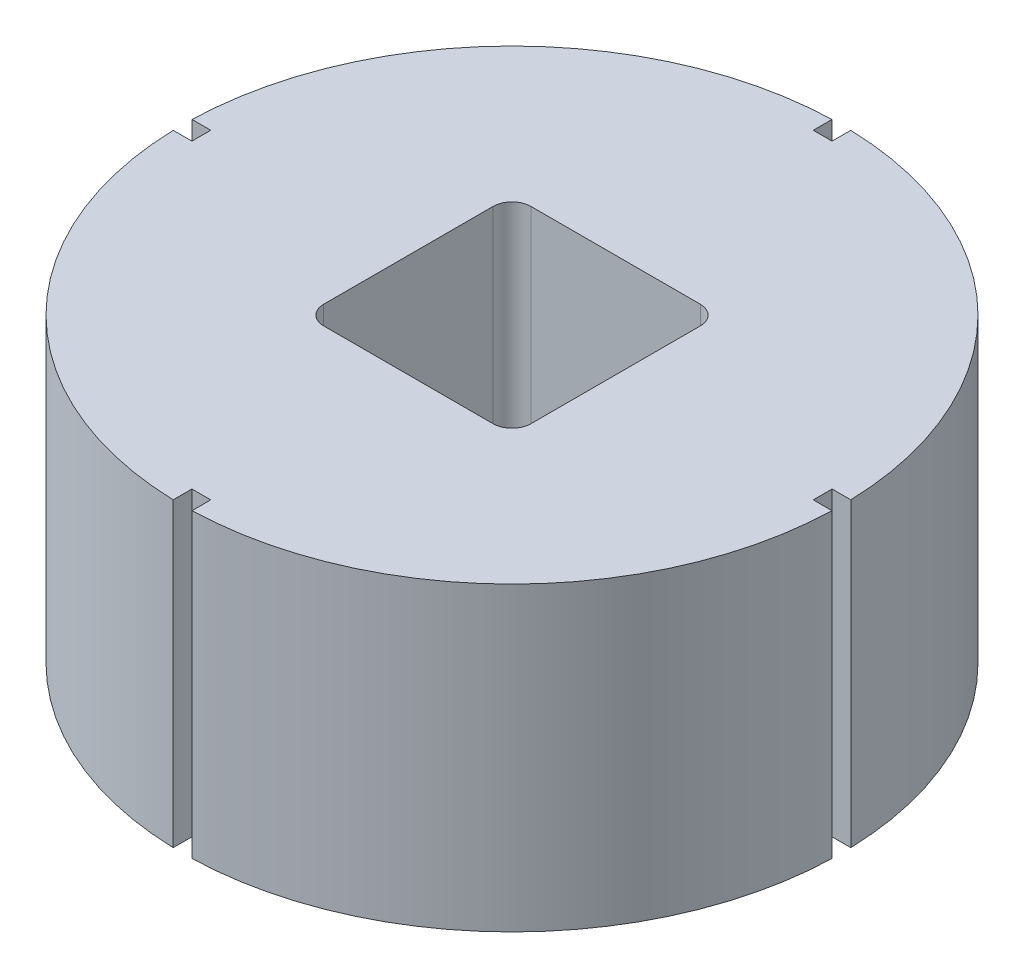
ISO-10303-21;
HEADER;
FILE_DESCRIPTION(('STEP AP214'),'2;1');
FILE_NAME('part.step','',(''),(''),'','','');
FILE_SCHEMA(('AUTOMOTIVE_DESIGN { 1 0 10303 214 1 1 1 1 }'));
ENDSEC;
DATA;
#1=APPLICATION_CONTEXT('core data for automotive mechanical design processes');
#2=APPLICATION_PROTOCOL_DEFINITION('international standard','automotive_design',2000,#1);
#3=PRODUCT_CONTEXT('',#1,'mechanical');
#4=PRODUCT('Part','Part','',(#3));
#5=PRODUCT_RELATED_PRODUCT_CATEGORY('part','',(#4));
#6=PRODUCT_DEFINITION_FORMATION('','',#4);
#7=PRODUCT_DEFINITION_CONTEXT('part definition',#1,'design');
#8=PRODUCT_DEFINITION('design','',#6,#7);
#9=PRODUCT_DEFINITION_SHAPE('','',#8);
#10=(LENGTH_UNIT() NAMED_UNIT(*) SI_UNIT(.MILLI.,.METRE.));
#11=(NAMED_UNIT(*) PLANE_ANGLE_UNIT() SI_UNIT($,.RADIAN.));
#12=(NAMED_UNIT(*) SI_UNIT($,.STERADIAN.) SOLID_ANGLE_UNIT());
#13=UNCERTAINTY_MEASURE_WITH_UNIT(LENGTH_MEASURE(1.E-05),#10,'distance_accuracy_value','');
#14=(GEOMETRIC_REPRESENTATION_CONTEXT(3) GLOBAL_UNCERTAINTY_ASSIGNED_CONTEXT((#13)) GLOBAL_UNIT_ASSIGNED_CONTEXT((#10,
#11,#12)) REPRESENTATION_CONTEXT('',''));
#15=CARTESIAN_POINT('',(0.,0.,0.));
#16=DIRECTION('',(0.,0.,1.));
#17=DIRECTION('',(1.,0.,0.));
#18=AXIS2_PLACEMENT_3D('',#15,#16,#17);
#19=CARTESIAN_POINT('',(0.,32.,0.));
#20=DIRECTION('',(0.,-1.,0.));
#21=DIRECTION('',(0.,0.,-1.));
#22=AXIS2_PLACEMENT_3D('',#19,#20,#21);
#23=CYLINDRICAL_SURFACE('',#22,35.);
#24=CARTESIAN_POINT('',(0.,0.,0.));
#25=DIRECTION('',(0.,1.,0.));
#26=DIRECTION('',(0.,0.,1.));
#27=AXIS2_PLACEMENT_3D('',#24,#25,#26);
#28=CIRCLE('',#27,35.);
#29=CARTESIAN_POINT('',(34.9857113690718,0.,-1.));
#30=VERTEX_POINT('',#29);
#31=CARTESIAN_POINT('',(1.,0.,-34.9857113690718));
#32=VERTEX_POINT('',#31);
#33=EDGE_CURVE('E231',#30,#32,#28,.T.);
#34=ORIENTED_EDGE('',*,*,#33,.T.);
#35=DIRECTION('',(0.,1.,0.));
#36=VECTOR('',#35,1.);
#37=CARTESIAN_POINT('',(1.,-4.,-34.9857113690718));
#38=LINE('',#37,#36);
#39=CARTESIAN_POINT('',(1.,32.,-34.9857113690718));
#40=VERTEX_POINT('',#39);
#41=EDGE_CURVE('E270',#32,#40,#38,.T.);
#42=ORIENTED_EDGE('',*,*,#41,.T.);
#43=CARTESIAN_POINT('',(0.,32.,0.));
#44=DIRECTION('',(0.,1.,0.));
#45=DIRECTION('',(0.,0.,1.));
#46=AXIS2_PLACEMENT_3D('',#43,#44,#45);
#47=CIRCLE('',#46,35.);
#48=CARTESIAN_POINT('',(34.9857113690718,32.,-1.));
#49=VERTEX_POINT('',#48);
#50=EDGE_CURVE('E217',#49,#40,#47,.T.);
#51=ORIENTED_EDGE('',*,*,#50,.F.);
#52=DIRECTION('',(0.,1.,0.));
#53=VECTOR('',#52,1.);
#54=CARTESIAN_POINT('',(34.9857113690718,-4.,-1.));
#55=LINE('',#54,#53);
#56=EDGE_CURVE('E286',#30,#49,#55,.T.);
#57=ORIENTED_EDGE('',*,*,#56,.F.);
#58=EDGE_LOOP('',(#34,#42,#51,#57));
#59=FACE_BOUND('',#58,.T.);
#60=ADVANCED_FACE('F32',(#59),#23,.T.);
#61=CARTESIAN_POINT('',(1.00000000000001,0.,34.9857113690718));
#62=VERTEX_POINT('',#61);
#63=CARTESIAN_POINT('',(34.9857113690718,0.,0.999999999999998));
#64=VERTEX_POINT('',#63);
#65=EDGE_CURVE('E223',#62,#64,#28,.T.);
#66=ORIENTED_EDGE('',*,*,#65,.T.);
#67=DIRECTION('',(0.,1.,0.));
#68=VECTOR('',#67,1.);
#69=CARTESIAN_POINT('',(34.9857113690718,-4.,0.999999999999998));
#70=LINE('',#69,#68);
#71=CARTESIAN_POINT('',(34.9857113690718,32.,0.999999999999998));
#72=VERTEX_POINT('',#71);
#73=EDGE_CURVE('E213',#64,#72,#70,.T.);
#74=ORIENTED_EDGE('',*,*,#73,.T.);
#75=CARTESIAN_POINT('',(1.00000000000001,32.,34.9857113690718));
#76=VERTEX_POINT('',#75);
#77=EDGE_CURVE('E221',#76,#72,#47,.T.);
#78=ORIENTED_EDGE('',*,*,#77,.F.);
#79=DIRECTION('',(0.,1.,0.));
#80=VECTOR('',#79,1.);
#81=CARTESIAN_POINT('',(1.00000000000001,-4.,34.9857113690718));
#82=LINE('',#81,#80);
#83=EDGE_CURVE('E301',#62,#76,#82,.T.);
#84=ORIENTED_EDGE('',*,*,#83,.F.);
#85=EDGE_LOOP('',(#66,#74,#78,#84));
#86=FACE_BOUND('',#85,.T.);
#87=ADVANCED_FACE('F410',(#86),#23,.T.);
#88=CARTESIAN_POINT('',(-34.9857113690718,0.,1.00000000000001));
#89=VERTEX_POINT('',#88);
#90=CARTESIAN_POINT('',(-0.999999999999996,0.,34.9857113690718));
#91=VERTEX_POINT('',#90);
#92=EDGE_CURVE('E232',#89,#91,#28,.T.);
#93=ORIENTED_EDGE('',*,*,#92,.T.);
#94=DIRECTION('',(0.,1.,0.));
#95=VECTOR('',#94,1.);
#96=CARTESIAN_POINT('',(-0.999999999999996,-4.,34.9857113690718));
#97=LINE('',#96,#95);
#98=CARTESIAN_POINT('',(-0.999999999999996,32.,34.9857113690718));
#99=VERTEX_POINT('',#98);
#100=EDGE_CURVE('E281',#91,#99,#97,.T.);
#101=ORIENTED_EDGE('',*,*,#100,.T.);
#102=CARTESIAN_POINT('',(-34.9857113690718,32.,1.00000000000001));
#103=VERTEX_POINT('',#102);
#104=EDGE_CURVE('E218',#103,#99,#47,.T.);
#105=ORIENTED_EDGE('',*,*,#104,.F.);
#106=DIRECTION('',(0.,1.,0.));
#107=VECTOR('',#106,1.);
#108=CARTESIAN_POINT('',(-34.9857113690718,-4.,1.00000000000001));
#109=LINE('',#108,#107);
#110=EDGE_CURVE('E317',#89,#103,#109,.T.);
#111=ORIENTED_EDGE('',*,*,#110,.F.);
#112=EDGE_LOOP('',(#93,#101,#105,#111));
#113=FACE_BOUND('',#112,.T.);
#114=ADVANCED_FACE('F424',(#113),#23,.T.);
#115=CARTESIAN_POINT('',(-1.,32.,-34.9857113690718));
#116=VERTEX_POINT('',#115);
#117=CARTESIAN_POINT('',(-34.9857113690718,32.,-0.999999999999994));
#118=VERTEX_POINT('',#117);
#119=EDGE_CURVE('E210',#116,#118,#47,.T.);
#120=ORIENTED_EDGE('',*,*,#119,.F.);
#121=DIRECTION('',(0.,1.,0.));
#122=VECTOR('',#121,1.);
#123=CARTESIAN_POINT('',(-1.,-4.,-34.9857113690718));
#124=LINE('',#123,#122);
#125=CARTESIAN_POINT('',(-1.,0.,-34.9857113690718));
#126=VERTEX_POINT('',#125);
#127=EDGE_CURVE('E191',#126,#116,#124,.T.);
#128=ORIENTED_EDGE('',*,*,#127,.F.);
#129=CARTESIAN_POINT('',(-34.9857113690718,0.,-0.999999999999994));
#130=VERTEX_POINT('',#129);
#131=EDGE_CURVE('E391',#126,#130,#28,.T.);
#132=ORIENTED_EDGE('',*,*,#131,.T.);
#133=DIRECTION('',(0.,1.,0.));
#134=VECTOR('',#133,1.);
#135=CARTESIAN_POINT('',(-34.9857113690718,-4.,-0.999999999999994));
#136=LINE('',#135,#134);
#137=EDGE_CURVE('E216',#130,#118,#136,.T.);
#138=ORIENTED_EDGE('',*,*,#137,.T.);
#139=EDGE_LOOP('',(#120,#128,#132,#138));
#140=FACE_BOUND('',#139,.T.);
#141=ADVANCED_FACE('F34',(#140),#23,.T.);
#142=CARTESIAN_POINT('',(0.,32.,0.));
#143=DIRECTION('',(0.,1.,0.));
#144=DIRECTION('',(0.,0.,1.));
#145=AXIS2_PLACEMENT_3D('',#142,#143,#144);
#146=PLANE('',#145);
#147=DIRECTION('',(0.,0.,-1.));
#148=VECTOR('',#147,1.);
#149=CARTESIAN_POINT('',(1.,32.,-33.));
#150=LINE('',#149,#148);
#151=CARTESIAN_POINT('',(1.,32.,-33.));
#152=VERTEX_POINT('',#151);
#153=EDGE_CURVE('E202',#152,#40,#150,.T.);
#154=ORIENTED_EDGE('',*,*,#153,.F.);
#155=DIRECTION('',(1.,0.,0.));
#156=VECTOR('',#155,1.);
#157=CARTESIAN_POINT('',(-1.,32.,-33.));
#158=LINE('',#157,#156);
#159=CARTESIAN_POINT('',(-1.,32.,-33.));
#160=VERTEX_POINT('',#159);
#161=EDGE_CURVE('E212',#160,#152,#158,.T.);
#162=ORIENTED_EDGE('',*,*,#161,.F.);
#163=DIRECTION('',(0.,0.,1.));
#164=VECTOR('',#163,1.);
#165=CARTESIAN_POINT('',(-1.,32.,-34.9857113690718));
#166=LINE('',#165,#164);
#167=EDGE_CURVE('E194',#116,#160,#166,.T.);
#168=ORIENTED_EDGE('',*,*,#167,.F.);
#169=ORIENTED_EDGE('',*,*,#119,.T.);
#170=DIRECTION('',(-1.,0.,0.));
#171=VECTOR('',#170,1.);
#172=CARTESIAN_POINT('',(-33.,32.,-0.999999999999994));
#173=LINE('',#172,#171);
#174=CARTESIAN_POINT('',(-33.,32.,-0.999999999999994));
#175=VERTEX_POINT('',#174);
#176=EDGE_CURVE('E315',#175,#118,#173,.T.);
#177=ORIENTED_EDGE('',*,*,#176,.F.);
#178=DIRECTION('',(0.,0.,-1.));
#179=VECTOR('',#178,1.);
#180=CARTESIAN_POINT('',(-33.,32.,1.00000000000001));
#181=LINE('',#180,#179);
#182=CARTESIAN_POINT('',(-33.,32.,1.00000000000001));
#183=VERTEX_POINT('',#182);
#184=EDGE_CURVE('E312',#183,#175,#181,.T.);
#185=ORIENTED_EDGE('',*,*,#184,.F.);
#186=DIRECTION('',(1.,0.,0.));
#187=VECTOR('',#186,1.);
#188=CARTESIAN_POINT('',(-34.9857113690718,32.,1.00000000000001));
#189=LINE('',#188,#187);
#190=EDGE_CURVE('E309',#103,#183,#189,.T.);
#191=ORIENTED_EDGE('',*,*,#190,.F.);
#192=ORIENTED_EDGE('',*,*,#104,.T.);
#193=DIRECTION('',(0.,0.,1.));
#194=VECTOR('',#193,1.);
#195=CARTESIAN_POINT('',(-0.999999999999996,32.,33.));
#196=LINE('',#195,#194);
#197=CARTESIAN_POINT('',(-0.999999999999996,32.,33.));
#198=VERTEX_POINT('',#197);
#199=EDGE_CURVE('E299',#198,#99,#196,.T.);
#200=ORIENTED_EDGE('',*,*,#199,.F.);
#201=DIRECTION('',(-1.,0.,0.));
#202=VECTOR('',#201,1.);
#203=CARTESIAN_POINT('',(1.00000000000001,32.,33.));
#204=LINE('',#203,#202);
#205=CARTESIAN_POINT('',(1.00000000000001,32.,33.));
#206=VERTEX_POINT('',#205);
#207=EDGE_CURVE('E296',#206,#198,#204,.T.);
#208=ORIENTED_EDGE('',*,*,#207,.F.);
#209=DIRECTION('',(0.,0.,-1.));
#210=VECTOR('',#209,1.);
#211=CARTESIAN_POINT('',(1.00000000000001,32.,34.9857113690718));
#212=LINE('',#211,#210);
#213=EDGE_CURVE('E293',#76,#206,#212,.T.);
#214=ORIENTED_EDGE('',*,*,#213,.F.);
#215=ORIENTED_EDGE('',*,*,#77,.T.);
#216=DIRECTION('',(1.,0.,0.));
#217=VECTOR('',#216,1.);
#218=CARTESIAN_POINT('',(33.,32.,0.999999999999998));
#219=LINE('',#218,#217);
#220=CARTESIAN_POINT('',(33.,32.,0.999999999999998));
#221=VERTEX_POINT('',#220);
#222=EDGE_CURVE('E284',#221,#72,#219,.T.);
#223=ORIENTED_EDGE('',*,*,#222,.F.);
#224=DIRECTION('',(0.,0.,1.));
#225=VECTOR('',#224,1.);
#226=CARTESIAN_POINT('',(33.,32.,-1.));
#227=LINE('',#226,#225);
#228=CARTESIAN_POINT('',(33.,32.,-1.));
#229=VERTEX_POINT('',#228);
#230=EDGE_CURVE('E280',#229,#221,#227,.T.);
#231=ORIENTED_EDGE('',*,*,#230,.F.);
#232=DIRECTION('',(-1.,0.,0.));
#233=VECTOR('',#232,1.);
#234=CARTESIAN_POINT('',(34.9857113690718,32.,-1.));
#235=LINE('',#234,#233);
#236=EDGE_CURVE('E278',#49,#229,#235,.T.);
#237=ORIENTED_EDGE('',*,*,#236,.F.);
#238=ORIENTED_EDGE('',*,*,#50,.T.);
#239=EDGE_LOOP('',(#154,#162,#168,#169,#177,#185,#191,#192,#200,#208,#214,#215,#223,#231,#237,#238));
#240=FACE_BOUND('',#239,.T.);
#241=CARTESIAN_POINT('',(-9.,32.,9.));
#242=DIRECTION('',(0.,1.,0.));
#243=DIRECTION('',(0.,0.,1.));
#244=AXIS2_PLACEMENT_3D('',#241,#242,#243);
#245=CIRCLE('',#244,2.);
#246=CARTESIAN_POINT('',(-11.,32.,8.99999999999999));
#247=VERTEX_POINT('',#246);
#248=CARTESIAN_POINT('',(-8.99999999999998,32.,11.));
#249=VERTEX_POINT('',#248);
#250=EDGE_CURVE('E273',#247,#249,#245,.T.);
#251=ORIENTED_EDGE('',*,*,#250,.F.);
#252=DIRECTION('',(0.,0.,1.));
#253=VECTOR('',#252,1.);
#254=CARTESIAN_POINT('',(-11.,32.,-8.99999999999998));
#255=LINE('',#254,#253);
#256=CARTESIAN_POINT('',(-11.,32.,-8.99999999999998));
#257=VERTEX_POINT('',#256);
#258=EDGE_CURVE('E328',#257,#247,#255,.T.);
#259=ORIENTED_EDGE('',*,*,#258,.F.);
#260=CARTESIAN_POINT('',(-9.,32.,-9.));
#261=DIRECTION('',(0.,1.,0.));
#262=DIRECTION('',(0.,0.,1.));
#263=AXIS2_PLACEMENT_3D('',#260,#261,#262);
#264=CIRCLE('',#263,2.);
#265=CARTESIAN_POINT('',(-8.99999999999999,32.,-11.));
#266=VERTEX_POINT('',#265);
#267=EDGE_CURVE('E366',#266,#257,#264,.T.);
#268=ORIENTED_EDGE('',*,*,#267,.F.);
#269=DIRECTION('',(-1.,0.,0.));
#270=VECTOR('',#269,1.);
#271=CARTESIAN_POINT('',(-8.99999999999999,32.,-11.));
#272=LINE('',#271,#270);
#273=CARTESIAN_POINT('',(8.99999999999998,32.,-11.));
#274=VERTEX_POINT('',#273);
#275=EDGE_CURVE('E363',#274,#266,#272,.T.);
#276=ORIENTED_EDGE('',*,*,#275,.F.);
#277=CARTESIAN_POINT('',(9.,32.,-9.));
#278=DIRECTION('',(0.,1.,0.));
#279=DIRECTION('',(0.,0.,-1.));
#280=AXIS2_PLACEMENT_3D('',#277,#278,#279);
#281=CIRCLE('',#280,2.);
#282=CARTESIAN_POINT('',(11.,32.,-8.99999999999998));
#283=VERTEX_POINT('',#282);
#284=EDGE_CURVE('E360',#283,#274,#281,.T.);
#285=ORIENTED_EDGE('',*,*,#284,.F.);
#286=DIRECTION('',(0.,0.,-1.));
#287=VECTOR('',#286,1.);
#288=CARTESIAN_POINT('',(11.,32.,-8.99999999999998));
#289=LINE('',#288,#287);
#290=CARTESIAN_POINT('',(11.,32.,8.99999999999999));
#291=VERTEX_POINT('',#290);
#292=EDGE_CURVE('E357',#291,#283,#289,.T.);
#293=ORIENTED_EDGE('',*,*,#292,.F.);
#294=CARTESIAN_POINT('',(9.,32.,9.));
#295=DIRECTION('',(0.,1.,0.));
#296=DIRECTION('',(0.,0.,1.));
#297=AXIS2_PLACEMENT_3D('',#294,#295,#296);
#298=CIRCLE('',#297,2.);
#299=CARTESIAN_POINT('',(8.99999999999999,32.,11.));
#300=VERTEX_POINT('',#299);
#301=EDGE_CURVE('E354',#300,#291,#298,.T.);
#302=ORIENTED_EDGE('',*,*,#301,.F.);
#303=DIRECTION('',(1.,0.,0.));
#304=VECTOR('',#303,1.);
#305=CARTESIAN_POINT('',(-8.99999999999998,32.,11.));
#306=LINE('',#305,#304);
#307=EDGE_CURVE('E351',#249,#300,#306,.T.);
#308=ORIENTED_EDGE('',*,*,#307,.F.);
#309=EDGE_LOOP('',(#251,#259,#268,#276,#285,#293,#302,#308));
#310=FACE_BOUND('',#309,.T.);
#311=ADVANCED_FACE('F207',(#240,#310),#146,.T.);
#312=CARTESIAN_POINT('',(0.,0.,0.));
#313=DIRECTION('',(0.,1.,0.));
#314=DIRECTION('',(0.,0.,1.));
#315=AXIS2_PLACEMENT_3D('',#312,#313,#314);
#316=PLANE('',#315);
#317=CARTESIAN_POINT('',(0.,0.,0.));
#318=DIRECTION('',(0.,-1.,0.));
#319=DIRECTION('',(0.,0.,-1.));
#320=AXIS2_PLACEMENT_3D('',#317,#318,#319);
#321=CIRCLE('',#320,10.);
#322=CARTESIAN_POINT('',(0.,0.,-10.));
#323=VERTEX_POINT('',#322);
#324=EDGE_CURVE('E227',#323,#323,#321,.T.);
#325=ORIENTED_EDGE('',*,*,#324,.F.);
#326=EDGE_LOOP('',(#325));
#327=FACE_BOUND('',#326,.T.);
#328=DIRECTION('',(1.,0.,0.));
#329=VECTOR('',#328,1.);
#330=CARTESIAN_POINT('',(0.,0.,-33.));
#331=LINE('',#330,#329);
#332=CARTESIAN_POINT('',(-1.,0.,-33.));
#333=VERTEX_POINT('',#332);
#334=CARTESIAN_POINT('',(1.,0.,-33.));
#335=VERTEX_POINT('',#334);
#336=EDGE_CURVE('E40',#333,#335,#331,.T.);
#337=ORIENTED_EDGE('',*,*,#336,.T.);
#338=DIRECTION('',(0.,0.,-1.));
#339=VECTOR('',#338,1.);
#340=CARTESIAN_POINT('',(0.999999999999997,0.,0.));
#341=LINE('',#340,#339);
#342=EDGE_CURVE('E11',#335,#32,#341,.T.);
#343=ORIENTED_EDGE('',*,*,#342,.T.);
#344=ORIENTED_EDGE('',*,*,#33,.F.);
#345=DIRECTION('',(-1.,0.,0.));
#346=VECTOR('',#345,1.);
#347=CARTESIAN_POINT('',(0.,0.,-0.999999999999993));
#348=LINE('',#347,#346);
#349=CARTESIAN_POINT('',(33.,0.,-1.));
#350=VERTEX_POINT('',#349);
#351=EDGE_CURVE('E251',#30,#350,#348,.T.);
#352=ORIENTED_EDGE('',*,*,#351,.T.);
#353=DIRECTION('',(0.,0.,1.));
#354=VECTOR('',#353,1.);
#355=CARTESIAN_POINT('',(33.,0.,0.));
#356=LINE('',#355,#354);
#357=CARTESIAN_POINT('',(33.,0.,0.999999999999998));
#358=VERTEX_POINT('',#357);
#359=EDGE_CURVE('E254',#350,#358,#356,.T.);
#360=ORIENTED_EDGE('',*,*,#359,.T.);
#361=DIRECTION('',(1.,0.,0.));
#362=VECTOR('',#361,1.);
#363=CARTESIAN_POINT('',(0.,0.,0.999999999999998));
#364=LINE('',#363,#362);
#365=EDGE_CURVE('E257',#358,#64,#364,.T.);
#366=ORIENTED_EDGE('',*,*,#365,.T.);
#367=ORIENTED_EDGE('',*,*,#65,.F.);
#368=DIRECTION('',(0.,0.,-1.));
#369=VECTOR('',#368,1.);
#370=CARTESIAN_POINT('',(0.999999999999995,0.,0.));
#371=LINE('',#370,#369);
#372=CARTESIAN_POINT('',(1.00000000000001,0.,33.));
#373=VERTEX_POINT('',#372);
#374=EDGE_CURVE('E242',#62,#373,#371,.T.);
#375=ORIENTED_EDGE('',*,*,#374,.T.);
#376=DIRECTION('',(-1.,0.,0.));
#377=VECTOR('',#376,1.);
#378=CARTESIAN_POINT('',(0.,0.,33.));
#379=LINE('',#378,#377);
#380=CARTESIAN_POINT('',(-0.999999999999996,0.,33.));
#381=VERTEX_POINT('',#380);
#382=EDGE_CURVE('E245',#373,#381,#379,.T.);
#383=ORIENTED_EDGE('',*,*,#382,.T.);
#384=DIRECTION('',(0.,0.,1.));
#385=VECTOR('',#384,1.);
#386=CARTESIAN_POINT('',(-0.999999999999996,0.,0.));
#387=LINE('',#386,#385);
#388=EDGE_CURVE('E248',#381,#91,#387,.T.);
#389=ORIENTED_EDGE('',*,*,#388,.T.);
#390=ORIENTED_EDGE('',*,*,#92,.F.);
#391=DIRECTION('',(1.,0.,0.));
#392=VECTOR('',#391,1.);
#393=CARTESIAN_POINT('',(0.,0.,0.999999999999993));
#394=LINE('',#393,#392);
#395=CARTESIAN_POINT('',(-33.,0.,1.00000000000001));
#396=VERTEX_POINT('',#395);
#397=EDGE_CURVE('E233',#89,#396,#394,.T.);
#398=ORIENTED_EDGE('',*,*,#397,.T.);
#399=DIRECTION('',(0.,0.,-1.));
#400=VECTOR('',#399,1.);
#401=CARTESIAN_POINT('',(-33.,0.,0.));
#402=LINE('',#401,#400);
#403=CARTESIAN_POINT('',(-33.,0.,-0.999999999999994));
#404=VERTEX_POINT('',#403);
#405=EDGE_CURVE('E236',#396,#404,#402,.T.);
#406=ORIENTED_EDGE('',*,*,#405,.T.);
#407=DIRECTION('',(-1.,0.,0.));
#408=VECTOR('',#407,1.);
#409=CARTESIAN_POINT('',(0.,0.,-0.999999999999998));
#410=LINE('',#409,#408);
#411=EDGE_CURVE('E239',#404,#130,#410,.T.);
#412=ORIENTED_EDGE('',*,*,#411,.T.);
#413=ORIENTED_EDGE('',*,*,#131,.F.);
#414=DIRECTION('',(0.,0.,1.));
#415=VECTOR('',#414,1.);
#416=CARTESIAN_POINT('',(-0.999999999999994,0.,0.));
#417=LINE('',#416,#415);
#418=EDGE_CURVE('E197',#126,#333,#417,.T.);
#419=ORIENTED_EDGE('',*,*,#418,.T.);
#420=EDGE_LOOP('',(#337,#343,#344,#352,#360,#366,#367,#375,#383,#389,#390,#398,#406,#412,#413,#419));
#421=FACE_BOUND('',#420,.T.);
#422=ADVANCED_FACE('F262',(#327,#421),#316,.F.);
#423=CARTESIAN_POINT('',(0.,-4.99999999999999,0.));
#424=DIRECTION('',(0.,1.,0.));
#425=DIRECTION('',(0.,0.,1.));
#426=AXIS2_PLACEMENT_3D('',#423,#424,#425);
#427=CYLINDRICAL_SURFACE('',#426,10.);
#428=CARTESIAN_POINT('',(0.,-4.99999999999999,0.));
#429=DIRECTION('',(0.,-1.,0.));
#430=DIRECTION('',(0.,0.,-1.));
#431=AXIS2_PLACEMENT_3D('',#428,#429,#430);
#432=CIRCLE('',#431,10.);
#433=CARTESIAN_POINT('',(0.,-4.99999999999999,-10.));
#434=VERTEX_POINT('',#433);
#435=EDGE_CURVE('E373',#434,#434,#432,.T.);
#436=ORIENTED_EDGE('',*,*,#435,.F.);
#437=EDGE_LOOP('',(#436));
#438=FACE_BOUND('',#437,.T.);
#439=ORIENTED_EDGE('',*,*,#324,.T.);
#440=EDGE_LOOP('',(#439));
#441=FACE_BOUND('',#440,.T.);
#442=ADVANCED_FACE('F563',(#438,#441),#427,.T.);
#443=CARTESIAN_POINT('',(0.,-4.99999999999999,0.));
#444=DIRECTION('',(0.,-1.,0.));
#445=DIRECTION('',(0.,0.,-1.));
#446=AXIS2_PLACEMENT_3D('',#443,#444,#445);
#447=PLANE('',#446);
#448=ORIENTED_EDGE('',*,*,#435,.T.);
#449=EDGE_LOOP('',(#448));
#450=FACE_BOUND('',#449,.T.);
#451=ADVANCED_FACE('F553',(#450),#447,.T.);
#452=CARTESIAN_POINT('',(-9.,7.,9.));
#453=DIRECTION('',(0.,1.,0.));
#454=DIRECTION('',(0.,0.,1.));
#455=AXIS2_PLACEMENT_3D('',#452,#453,#454);
#456=CYLINDRICAL_SURFACE('',#455,2.);
#457=ORIENTED_EDGE('',*,*,#250,.T.);
#458=DIRECTION('',(0.,1.,0.));
#459=VECTOR('',#458,1.);
#460=CARTESIAN_POINT('',(-8.99999999999998,7.,11.));
#461=LINE('',#460,#459);
#462=CARTESIAN_POINT('',(-8.99999999999998,7.,11.));
#463=VERTEX_POINT('',#462);
#464=EDGE_CURVE('E349',#463,#249,#461,.T.);
#465=ORIENTED_EDGE('',*,*,#464,.F.);
#466=CARTESIAN_POINT('',(-9.,7.,9.));
#467=DIRECTION('',(0.,1.,0.));
#468=DIRECTION('',(0.,0.,1.));
#469=AXIS2_PLACEMENT_3D('',#466,#467,#468);
#470=CIRCLE('',#469,2.);
#471=CARTESIAN_POINT('',(-11.,7.,8.99999999999999));
#472=VERTEX_POINT('',#471);
#473=EDGE_CURVE('E324',#472,#463,#470,.T.);
#474=ORIENTED_EDGE('',*,*,#473,.F.);
#475=DIRECTION('',(0.,1.,0.));
#476=VECTOR('',#475,1.);
#477=CARTESIAN_POINT('',(-11.,7.,8.99999999999999));
#478=LINE('',#477,#476);
#479=EDGE_CURVE('E371',#472,#247,#478,.T.);
#480=ORIENTED_EDGE('',*,*,#479,.T.);
#481=EDGE_LOOP('',(#457,#465,#474,#480));
#482=FACE_BOUND('',#481,.T.);
#483=ADVANCED_FACE('F543',(#482),#456,.F.);
#484=CARTESIAN_POINT('',(-11.,7.,-8.99999999999998));
#485=DIRECTION('',(-1.,0.,0.));
#486=DIRECTION('',(0.,0.,1.));
#487=AXIS2_PLACEMENT_3D('',#484,#485,#486);
#488=PLANE('',#487);
#489=ORIENTED_EDGE('',*,*,#258,.T.);
#490=ORIENTED_EDGE('',*,*,#479,.F.);
#491=DIRECTION('',(0.,0.,1.));
#492=VECTOR('',#491,1.);
#493=CARTESIAN_POINT('',(-11.,7.,-8.99999999999998));
#494=LINE('',#493,#492);
#495=CARTESIAN_POINT('',(-11.,7.,-8.99999999999998));
#496=VERTEX_POINT('',#495);
#497=EDGE_CURVE('E346',#496,#472,#494,.T.);
#498=ORIENTED_EDGE('',*,*,#497,.F.);
#499=DIRECTION('',(0.,1.,0.));
#500=VECTOR('',#499,1.);
#501=CARTESIAN_POINT('',(-11.,7.,-8.99999999999998));
#502=LINE('',#501,#500);
#503=EDGE_CURVE('E374',#496,#257,#502,.T.);
#504=ORIENTED_EDGE('',*,*,#503,.T.);
#505=EDGE_LOOP('',(#489,#490,#498,#504));
#506=FACE_BOUND('',#505,.T.);
#507=ADVANCED_FACE('F533',(#506),#488,.F.);
#508=CARTESIAN_POINT('',(-9.,7.,-9.));
#509=DIRECTION('',(0.,1.,0.));
#510=DIRECTION('',(0.,0.,1.));
#511=AXIS2_PLACEMENT_3D('',#508,#509,#510);
#512=CYLINDRICAL_SURFACE('',#511,2.);
#513=ORIENTED_EDGE('',*,*,#267,.T.);
#514=ORIENTED_EDGE('',*,*,#503,.F.);
#515=CARTESIAN_POINT('',(-9.,7.,-9.));
#516=DIRECTION('',(0.,1.,0.));
#517=DIRECTION('',(0.,0.,1.));
#518=AXIS2_PLACEMENT_3D('',#515,#516,#517);
#519=CIRCLE('',#518,2.);
#520=CARTESIAN_POINT('',(-8.99999999999999,7.,-11.));
#521=VERTEX_POINT('',#520);
#522=EDGE_CURVE('E343',#521,#496,#519,.T.);
#523=ORIENTED_EDGE('',*,*,#522,.F.);
#524=DIRECTION('',(0.,1.,0.));
#525=VECTOR('',#524,1.);
#526=CARTESIAN_POINT('',(-8.99999999999999,7.,-11.));
#527=LINE('',#526,#525);
#528=EDGE_CURVE('E376',#521,#266,#527,.T.);
#529=ORIENTED_EDGE('',*,*,#528,.T.);
#530=EDGE_LOOP('',(#513,#514,#523,#529));
#531=FACE_BOUND('',#530,.T.);
#532=ADVANCED_FACE('F523',(#531),#512,.F.);
#533=CARTESIAN_POINT('',(-8.99999999999999,7.,-11.));
#534=DIRECTION('',(0.,0.,-1.));
#535=DIRECTION('',(-1.,0.,0.));
#536=AXIS2_PLACEMENT_3D('',#533,#534,#535);
#537=PLANE('',#536);
#538=ORIENTED_EDGE('',*,*,#275,.T.);
#539=ORIENTED_EDGE('',*,*,#528,.F.);
#540=DIRECTION('',(-1.,0.,0.));
#541=VECTOR('',#540,1.);
#542=CARTESIAN_POINT('',(-8.99999999999999,7.,-11.));
#543=LINE('',#542,#541);
#544=CARTESIAN_POINT('',(8.99999999999998,7.,-11.));
#545=VERTEX_POINT('',#544);
#546=EDGE_CURVE('E340',#545,#521,#543,.T.);
#547=ORIENTED_EDGE('',*,*,#546,.F.);
#548=DIRECTION('',(0.,1.,0.));
#549=VECTOR('',#548,1.);
#550=CARTESIAN_POINT('',(8.99999999999998,7.,-11.));
#551=LINE('',#550,#549);
#552=EDGE_CURVE('E378',#545,#274,#551,.T.);
#553=ORIENTED_EDGE('',*,*,#552,.T.);
#554=EDGE_LOOP('',(#538,#539,#547,#553));
#555=FACE_BOUND('',#554,.T.);
#556=ADVANCED_FACE('F513',(#555),#537,.F.);
#557=CARTESIAN_POINT('',(9.,7.,-9.));
#558=DIRECTION('',(0.,1.,0.));
#559=DIRECTION('',(0.,0.,1.));
#560=AXIS2_PLACEMENT_3D('',#557,#558,#559);
#561=CYLINDRICAL_SURFACE('',#560,2.);
#562=ORIENTED_EDGE('',*,*,#284,.T.);
#563=ORIENTED_EDGE('',*,*,#552,.F.);
#564=CARTESIAN_POINT('',(9.,7.,-9.));
#565=DIRECTION('',(0.,1.,0.));
#566=DIRECTION('',(0.,0.,-1.));
#567=AXIS2_PLACEMENT_3D('',#564,#565,#566);
#568=CIRCLE('',#567,2.);
#569=CARTESIAN_POINT('',(11.,7.,-8.99999999999998));
#570=VERTEX_POINT('',#569);
#571=EDGE_CURVE('E337',#570,#545,#568,.T.);
#572=ORIENTED_EDGE('',*,*,#571,.F.);
#573=DIRECTION('',(0.,1.,0.));
#574=VECTOR('',#573,1.);
#575=CARTESIAN_POINT('',(11.,7.,-8.99999999999998));
#576=LINE('',#575,#574);
#577=EDGE_CURVE('E380',#570,#283,#576,.T.);
#578=ORIENTED_EDGE('',*,*,#577,.T.);
#579=EDGE_LOOP('',(#562,#563,#572,#578));
#580=FACE_BOUND('',#579,.T.);
#581=ADVANCED_FACE('F503',(#580),#561,.F.);
#582=CARTESIAN_POINT('',(11.,7.,-8.99999999999998));
#583=DIRECTION('',(1.,0.,0.));
#584=DIRECTION('',(0.,0.,-1.));
#585=AXIS2_PLACEMENT_3D('',#582,#583,#584);
#586=PLANE('',#585);
#587=ORIENTED_EDGE('',*,*,#292,.T.);
#588=ORIENTED_EDGE('',*,*,#577,.F.);
#589=DIRECTION('',(0.,0.,-1.));
#590=VECTOR('',#589,1.);
#591=CARTESIAN_POINT('',(11.,7.,-8.99999999999998));
#592=LINE('',#591,#590);
#593=CARTESIAN_POINT('',(11.,7.,8.99999999999999));
#594=VERTEX_POINT('',#593);
#595=EDGE_CURVE('E334',#594,#570,#592,.T.);
#596=ORIENTED_EDGE('',*,*,#595,.F.);
#597=DIRECTION('',(0.,1.,0.));
#598=VECTOR('',#597,1.);
#599=CARTESIAN_POINT('',(11.,7.,8.99999999999999));
#600=LINE('',#599,#598);
#601=EDGE_CURVE('E382',#594,#291,#600,.T.);
#602=ORIENTED_EDGE('',*,*,#601,.T.);
#603=EDGE_LOOP('',(#587,#588,#596,#602));
#604=FACE_BOUND('',#603,.T.);
#605=ADVANCED_FACE('F493',(#604),#586,.F.);
#606=CARTESIAN_POINT('',(9.,7.,9.));
#607=DIRECTION('',(0.,1.,0.));
#608=DIRECTION('',(0.,0.,1.));
#609=AXIS2_PLACEMENT_3D('',#606,#607,#608);
#610=CYLINDRICAL_SURFACE('',#609,2.);
#611=ORIENTED_EDGE('',*,*,#301,.T.);
#612=ORIENTED_EDGE('',*,*,#601,.F.);
#613=CARTESIAN_POINT('',(9.,7.,9.));
#614=DIRECTION('',(0.,1.,0.));
#615=DIRECTION('',(0.,0.,1.));
#616=AXIS2_PLACEMENT_3D('',#613,#614,#615);
#617=CIRCLE('',#616,2.);
#618=CARTESIAN_POINT('',(8.99999999999999,7.,11.));
#619=VERTEX_POINT('',#618);
#620=EDGE_CURVE('E331',#619,#594,#617,.T.);
#621=ORIENTED_EDGE('',*,*,#620,.F.);
#622=DIRECTION('',(0.,1.,0.));
#623=VECTOR('',#622,1.);
#624=CARTESIAN_POINT('',(8.99999999999999,7.,11.));
#625=LINE('',#624,#623);
#626=EDGE_CURVE('E384',#619,#300,#625,.T.);
#627=ORIENTED_EDGE('',*,*,#626,.T.);
#628=EDGE_LOOP('',(#611,#612,#621,#627));
#629=FACE_BOUND('',#628,.T.);
#630=ADVANCED_FACE('F483',(#629),#610,.F.);
#631=CARTESIAN_POINT('',(-8.99999999999998,7.,11.));
#632=DIRECTION('',(0.,0.,1.));
#633=DIRECTION('',(1.,0.,0.));
#634=AXIS2_PLACEMENT_3D('',#631,#632,#633);
#635=PLANE('',#634);
#636=ORIENTED_EDGE('',*,*,#307,.T.);
#637=ORIENTED_EDGE('',*,*,#626,.F.);
#638=DIRECTION('',(1.,0.,0.));
#639=VECTOR('',#638,1.);
#640=CARTESIAN_POINT('',(-8.99999999999998,7.,11.));
#641=LINE('',#640,#639);
#642=EDGE_CURVE('E327',#463,#619,#641,.T.);
#643=ORIENTED_EDGE('',*,*,#642,.F.);
#644=ORIENTED_EDGE('',*,*,#464,.T.);
#645=EDGE_LOOP('',(#636,#637,#643,#644));
#646=FACE_BOUND('',#645,.T.);
#647=ADVANCED_FACE('F443',(#646),#635,.F.);
#648=CARTESIAN_POINT('',(-9.,7.,9.));
#649=DIRECTION('',(0.,1.,0.));
#650=DIRECTION('',(0.,0.,1.));
#651=AXIS2_PLACEMENT_3D('',#648,#649,#650);
#652=PLANE('',#651);
#653=ORIENTED_EDGE('',*,*,#473,.T.);
#654=ORIENTED_EDGE('',*,*,#642,.T.);
#655=ORIENTED_EDGE('',*,*,#620,.T.);
#656=ORIENTED_EDGE('',*,*,#595,.T.);
#657=ORIENTED_EDGE('',*,*,#571,.T.);
#658=ORIENTED_EDGE('',*,*,#546,.T.);
#659=ORIENTED_EDGE('',*,*,#522,.T.);
#660=ORIENTED_EDGE('',*,*,#497,.T.);
#661=EDGE_LOOP('',(#653,#654,#655,#656,#657,#658,#659,#660));
#662=FACE_BOUND('',#661,.T.);
#663=ADVANCED_FACE('F436',(#662),#652,.T.);
#664=CARTESIAN_POINT('',(-33.,-4.,-0.999999999999994));
#665=DIRECTION('',(0.,0.,-1.));
#666=DIRECTION('',(-1.,0.,0.));
#667=AXIS2_PLACEMENT_3D('',#664,#665,#666);
#668=PLANE('',#667);
#669=DIRECTION('',(0.,1.,0.));
#670=VECTOR('',#669,1.);
#671=CARTESIAN_POINT('',(-33.,-4.,-0.999999999999994));
#672=LINE('',#671,#670);
#673=EDGE_CURVE('E319',#404,#175,#672,.T.);
#674=ORIENTED_EDGE('',*,*,#673,.T.);
#675=ORIENTED_EDGE('',*,*,#176,.T.);
#676=ORIENTED_EDGE('',*,*,#137,.F.);
#677=ORIENTED_EDGE('',*,*,#411,.F.);
#678=EDGE_LOOP('',(#674,#675,#676,#677));
#679=FACE_BOUND('',#678,.T.);
#680=ADVANCED_FACE('F434',(#679),#668,.F.);
#681=CARTESIAN_POINT('',(-33.,-4.,1.00000000000001));
#682=DIRECTION('',(1.,0.,0.));
#683=DIRECTION('',(0.,0.,-1.));
#684=AXIS2_PLACEMENT_3D('',#681,#682,#683);
#685=PLANE('',#684);
#686=DIRECTION('',(0.,1.,0.));
#687=VECTOR('',#686,1.);
#688=CARTESIAN_POINT('',(-33.,-4.,1.00000000000001));
#689=LINE('',#688,#687);
#690=EDGE_CURVE('E321',#396,#183,#689,.T.);
#691=ORIENTED_EDGE('',*,*,#690,.T.);
#692=ORIENTED_EDGE('',*,*,#184,.T.);
#693=ORIENTED_EDGE('',*,*,#673,.F.);
#694=ORIENTED_EDGE('',*,*,#405,.F.);
#695=EDGE_LOOP('',(#691,#692,#693,#694));
#696=FACE_BOUND('',#695,.T.);
#697=ADVANCED_FACE('F432',(#696),#685,.F.);
#698=CARTESIAN_POINT('',(-34.9857113690718,-4.,1.00000000000001));
#699=DIRECTION('',(0.,0.,1.));
#700=DIRECTION('',(1.,0.,0.));
#701=AXIS2_PLACEMENT_3D('',#698,#699,#700);
#702=PLANE('',#701);
#703=ORIENTED_EDGE('',*,*,#110,.T.);
#704=ORIENTED_EDGE('',*,*,#190,.T.);
#705=ORIENTED_EDGE('',*,*,#690,.F.);
#706=ORIENTED_EDGE('',*,*,#397,.F.);
#707=EDGE_LOOP('',(#703,#704,#705,#706));
#708=FACE_BOUND('',#707,.T.);
#709=ADVANCED_FACE('F428',(#708),#702,.F.);
#710=CARTESIAN_POINT('',(-0.999999999999996,-4.,33.));
#711=DIRECTION('',(-1.,0.,0.));
#712=DIRECTION('',(0.,0.,1.));
#713=AXIS2_PLACEMENT_3D('',#710,#711,#712);
#714=PLANE('',#713);
#715=DIRECTION('',(0.,1.,0.));
#716=VECTOR('',#715,1.);
#717=CARTESIAN_POINT('',(-0.999999999999996,-4.,33.));
#718=LINE('',#717,#716);
#719=EDGE_CURVE('E304',#381,#198,#718,.T.);
#720=ORIENTED_EDGE('',*,*,#719,.T.);
#721=ORIENTED_EDGE('',*,*,#199,.T.);
#722=ORIENTED_EDGE('',*,*,#100,.F.);
#723=ORIENTED_EDGE('',*,*,#388,.F.);
#724=EDGE_LOOP('',(#720,#721,#722,#723));
#725=FACE_BOUND('',#724,.T.);
#726=ADVANCED_FACE('F422',(#725),#714,.F.);
#727=CARTESIAN_POINT('',(1.00000000000001,-4.,33.));
#728=DIRECTION('',(0.,0.,-1.));
#729=DIRECTION('',(-1.,0.,0.));
#730=AXIS2_PLACEMENT_3D('',#727,#728,#729);
#731=PLANE('',#730);
#732=DIRECTION('',(0.,1.,0.));
#733=VECTOR('',#732,1.);
#734=CARTESIAN_POINT('',(1.00000000000001,-4.,33.));
#735=LINE('',#734,#733);
#736=EDGE_CURVE('E306',#373,#206,#735,.T.);
#737=ORIENTED_EDGE('',*,*,#736,.T.);
#738=ORIENTED_EDGE('',*,*,#207,.T.);
#739=ORIENTED_EDGE('',*,*,#719,.F.);
#740=ORIENTED_EDGE('',*,*,#382,.F.);
#741=EDGE_LOOP('',(#737,#738,#739,#740));
#742=FACE_BOUND('',#741,.T.);
#743=ADVANCED_FACE('F419',(#742),#731,.F.);
#744=CARTESIAN_POINT('',(1.00000000000001,-4.,34.9857113690718));
#745=DIRECTION('',(1.,0.,0.));
#746=DIRECTION('',(0.,0.,-1.));
#747=AXIS2_PLACEMENT_3D('',#744,#745,#746);
#748=PLANE('',#747);
#749=ORIENTED_EDGE('',*,*,#83,.T.);
#750=ORIENTED_EDGE('',*,*,#213,.T.);
#751=ORIENTED_EDGE('',*,*,#736,.F.);
#752=ORIENTED_EDGE('',*,*,#374,.F.);
#753=EDGE_LOOP('',(#749,#750,#751,#752));
#754=FACE_BOUND('',#753,.T.);
#755=ADVANCED_FACE('F414',(#754),#748,.F.);
#756=CARTESIAN_POINT('',(33.,-4.,0.999999999999998));
#757=DIRECTION('',(0.,0.,1.));
#758=DIRECTION('',(1.,0.,0.));
#759=AXIS2_PLACEMENT_3D('',#756,#757,#758);
#760=PLANE('',#759);
#761=DIRECTION('',(0.,1.,0.));
#762=VECTOR('',#761,1.);
#763=CARTESIAN_POINT('',(33.,-4.,0.999999999999998));
#764=LINE('',#763,#762);
#765=EDGE_CURVE('E289',#358,#221,#764,.T.);
#766=ORIENTED_EDGE('',*,*,#765,.T.);
#767=ORIENTED_EDGE('',*,*,#222,.T.);
#768=ORIENTED_EDGE('',*,*,#73,.F.);
#769=ORIENTED_EDGE('',*,*,#365,.F.);
#770=EDGE_LOOP('',(#766,#767,#768,#769));
#771=FACE_BOUND('',#770,.T.);
#772=ADVANCED_FACE('F406',(#771),#760,.F.);
#773=CARTESIAN_POINT('',(33.,-4.,-1.));
#774=DIRECTION('',(-1.,0.,0.));
#775=DIRECTION('',(0.,0.,1.));
#776=AXIS2_PLACEMENT_3D('',#773,#774,#775);
#777=PLANE('',#776);
#778=DIRECTION('',(0.,1.,0.));
#779=VECTOR('',#778,1.);
#780=CARTESIAN_POINT('',(33.,-4.,-1.));
#781=LINE('',#780,#779);
#782=EDGE_CURVE('E55',#350,#229,#781,.T.);
#783=ORIENTED_EDGE('',*,*,#782,.T.);
#784=ORIENTED_EDGE('',*,*,#230,.T.);
#785=ORIENTED_EDGE('',*,*,#765,.F.);
#786=ORIENTED_EDGE('',*,*,#359,.F.);
#787=EDGE_LOOP('',(#783,#784,#785,#786));
#788=FACE_BOUND('',#787,.T.);
#789=ADVANCED_FACE('F404',(#788),#777,.F.);
#790=CARTESIAN_POINT('',(34.9857113690718,-4.,-1.));
#791=DIRECTION('',(0.,0.,-1.));
#792=DIRECTION('',(-1.,0.,0.));
#793=AXIS2_PLACEMENT_3D('',#790,#791,#792);
#794=PLANE('',#793);
#795=ORIENTED_EDGE('',*,*,#56,.T.);
#796=ORIENTED_EDGE('',*,*,#236,.T.);
#797=ORIENTED_EDGE('',*,*,#782,.F.);
#798=ORIENTED_EDGE('',*,*,#351,.F.);
#799=EDGE_LOOP('',(#795,#796,#797,#798));
#800=FACE_BOUND('',#799,.T.);
#801=ADVANCED_FACE('F398',(#800),#794,.F.);
#802=CARTESIAN_POINT('',(1.,-4.,-33.));
#803=DIRECTION('',(1.,0.,0.));
#804=DIRECTION('',(0.,0.,-1.));
#805=AXIS2_PLACEMENT_3D('',#802,#803,#804);
#806=PLANE('',#805);
#807=DIRECTION('',(0.,1.,0.));
#808=VECTOR('',#807,1.);
#809=CARTESIAN_POINT('',(1.,-4.,-33.));
#810=LINE('',#809,#808);
#811=EDGE_CURVE('E268',#335,#152,#810,.T.);
#812=ORIENTED_EDGE('',*,*,#811,.T.);
#813=ORIENTED_EDGE('',*,*,#153,.T.);
#814=ORIENTED_EDGE('',*,*,#41,.F.);
#815=ORIENTED_EDGE('',*,*,#342,.F.);
#816=EDGE_LOOP('',(#812,#813,#814,#815));
#817=FACE_BOUND('',#816,.T.);
#818=ADVANCED_FACE('F655',(#817),#806,.F.);
#819=CARTESIAN_POINT('',(-1.,-4.,-33.));
#820=DIRECTION('',(0.,0.,1.));
#821=DIRECTION('',(1.,0.,0.));
#822=AXIS2_PLACEMENT_3D('',#819,#820,#821);
#823=PLANE('',#822);
#824=DIRECTION('',(0.,1.,0.));
#825=VECTOR('',#824,1.);
#826=CARTESIAN_POINT('',(-1.,-4.,-33.));
#827=LINE('',#826,#825);
#828=EDGE_CURVE('E47',#333,#160,#827,.T.);
#829=ORIENTED_EDGE('',*,*,#828,.T.);
#830=ORIENTED_EDGE('',*,*,#161,.T.);
#831=ORIENTED_EDGE('',*,*,#811,.F.);
#832=ORIENTED_EDGE('',*,*,#336,.F.);
#833=EDGE_LOOP('',(#829,#830,#831,#832));
#834=FACE_BOUND('',#833,.T.);
#835=ADVANCED_FACE('F267',(#834),#823,.F.);
#836=CARTESIAN_POINT('',(-1.,-4.,-34.9857113690718));
#837=DIRECTION('',(-1.,0.,0.));
#838=DIRECTION('',(0.,0.,1.));
#839=AXIS2_PLACEMENT_3D('',#836,#837,#838);
#840=PLANE('',#839);
#841=ORIENTED_EDGE('',*,*,#127,.T.);
#842=ORIENTED_EDGE('',*,*,#167,.T.);
#843=ORIENTED_EDGE('',*,*,#828,.F.);
#844=ORIENTED_EDGE('',*,*,#418,.F.);
#845=EDGE_LOOP('',(#841,#842,#843,#844));
#846=FACE_BOUND('',#845,.T.);
#847=ADVANCED_FACE('F193',(#846),#840,.F.);
#848=CLOSED_SHELL('',(#60,#87,#114,#141,#311,#422,#442,#451,#483,#507,#532,#556,#581,#605,#630,
#647,#663,#680,#697,#709,#726,#743,#755,#772,#789,#801,#818,#835,#847));
#849=MANIFOLD_SOLID_BREP('B2',#848);
#850=ADVANCED_BREP_SHAPE_REPRESENTATION('',(#18,#849),#14);
#851=SHAPE_DEFINITION_REPRESENTATION(#9,#850);
ENDSEC;
END-ISO-10303-21;
